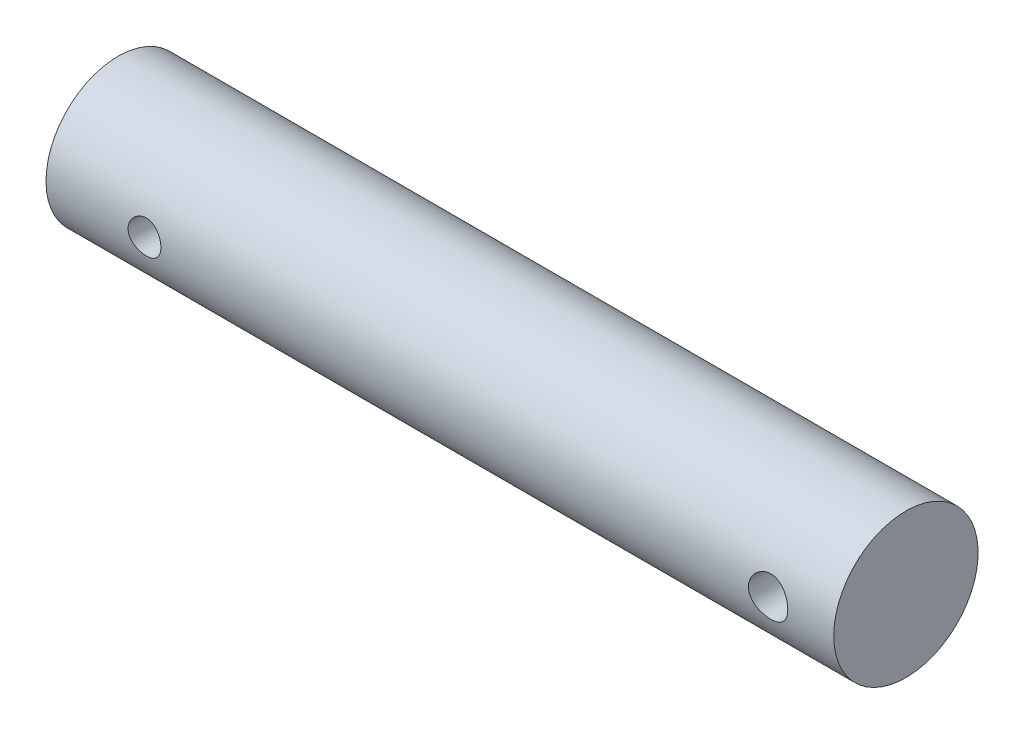
ISO-10303-21;
HEADER;
FILE_DESCRIPTION(('STEP AP214'),'2;1');
FILE_NAME('part.step','',(''),(''),'','','');
FILE_SCHEMA(('AUTOMOTIVE_DESIGN { 1 0 10303 214 1 1 1 1 }'));
ENDSEC;
DATA;
#1=APPLICATION_CONTEXT('core data for automotive mechanical design processes');
#2=APPLICATION_PROTOCOL_DEFINITION('international standard','automotive_design',2000,#1);
#3=PRODUCT_CONTEXT('',#1,'mechanical');
#4=PRODUCT('Part','Part','',(#3));
#5=PRODUCT_RELATED_PRODUCT_CATEGORY('part','',(#4));
#6=PRODUCT_DEFINITION_FORMATION('','',#4);
#7=PRODUCT_DEFINITION_CONTEXT('part definition',#1,'design');
#8=PRODUCT_DEFINITION('design','',#6,#7);
#9=PRODUCT_DEFINITION_SHAPE('','',#8);
#10=(LENGTH_UNIT() NAMED_UNIT(*) SI_UNIT(.MILLI.,.METRE.));
#11=(NAMED_UNIT(*) PLANE_ANGLE_UNIT() SI_UNIT($,.RADIAN.));
#12=(NAMED_UNIT(*) SI_UNIT($,.STERADIAN.) SOLID_ANGLE_UNIT());
#13=UNCERTAINTY_MEASURE_WITH_UNIT(LENGTH_MEASURE(1.E-05),#10,'distance_accuracy_value','');
#14=(GEOMETRIC_REPRESENTATION_CONTEXT(3) GLOBAL_UNCERTAINTY_ASSIGNED_CONTEXT((#13)) GLOBAL_UNIT_ASSIGNED_CONTEXT((#10,
#11,#12)) REPRESENTATION_CONTEXT('',''));
#15=CARTESIAN_POINT('',(0.,0.,0.));
#16=DIRECTION('',(0.,0.,1.));
#17=DIRECTION('',(1.,0.,0.));
#18=AXIS2_PLACEMENT_3D('',#15,#16,#17);
#19=CARTESIAN_POINT('',(0.,0.,0.));
#20=DIRECTION('',(-1.,0.,0.));
#21=DIRECTION('',(0.,0.,1.));
#22=AXIS2_PLACEMENT_3D('',#19,#20,#21);
#23=PLANE('',#22);
#24=CARTESIAN_POINT('',(0.,0.,0.));
#25=DIRECTION('',(-1.,0.,0.));
#26=DIRECTION('',(0.,0.,1.));
#27=AXIS2_PLACEMENT_3D('',#24,#25,#26);
#28=CIRCLE('',#27,11.);
#29=CARTESIAN_POINT('',(0.,0.,11.));
#30=VERTEX_POINT('',#29);
#31=EDGE_CURVE('E56',#30,#30,#28,.T.);
#32=ORIENTED_EDGE('',*,*,#31,.F.);
#33=EDGE_LOOP('',(#32));
#34=FACE_BOUND('',#33,.T.);
#35=ADVANCED_FACE('F36',(#34),#23,.F.);
#36=CARTESIAN_POINT('',(-120.,0.,0.));
#37=DIRECTION('',(-1.,0.,0.));
#38=DIRECTION('',(0.,0.,1.));
#39=AXIS2_PLACEMENT_3D('',#36,#37,#38);
#40=CYLINDRICAL_SURFACE('',#39,11.);
#41=CARTESIAN_POINT('',(-102.5,0.,-11.));
#42=CARTESIAN_POINT('',(-102.500004531826,0.138518278596905,-10.9999974735185));
#43=CARTESIAN_POINT('',(-102.511551227577,0.277090172258008,-10.9973570934613));
#44=CARTESIAN_POINT('',(-102.557379476062,0.550288594599323,-10.987079320306));
#45=CARTESIAN_POINT('',(-102.591676395955,0.68491239222073,-10.9794385496265));
#46=CARTESIAN_POINT('',(-102.681868048632,0.946227671984914,-10.9600095312294));
#47=CARTESIAN_POINT('',(-102.737739327981,1.07292759495647,-10.9482257885674));
#48=CARTESIAN_POINT('',(-102.869417113381,1.31515227582566,-10.921778201627));
#49=CARTESIAN_POINT('',(-102.945223420842,1.43067714503182,-10.9071143860398));
#50=CARTESIAN_POINT('',(-103.116002044607,1.64926760444638,-10.8762265816814));
#51=CARTESIAN_POINT('',(-103.211252573475,1.75211293892049,-10.8599819758326));
#52=CARTESIAN_POINT('',(-103.417618974137,1.9405138981661,-10.827906511833));
#53=CARTESIAN_POINT('',(-103.528736350694,2.02606788121783,-10.8120756930933));
#54=CARTESIAN_POINT('',(-103.765332055284,2.17844599401786,-10.7824158369221));
#55=CARTESIAN_POINT('',(-103.890966996306,2.24503254356575,-10.7686131580577));
#56=CARTESIAN_POINT('',(-104.152009500582,2.35606069717869,-10.7448696147509));
#57=CARTESIAN_POINT('',(-104.287415792062,2.40050517717749,-10.7349282488168));
#58=CARTESIAN_POINT('',(-104.561759187117,2.46525349412717,-10.7202434469831));
#59=CARTESIAN_POINT('',(-104.700599263123,2.48594892680753,-10.715415797339));
#60=CARTESIAN_POINT('',(-104.979858227213,2.50382988451486,-10.7112523406768));
#61=CARTESIAN_POINT('',(-105.120276902662,2.50101853886552,-10.711915802658));
#62=CARTESIAN_POINT('',(-105.395772883349,2.47228016958762,-10.7185835035919));
#63=CARTESIAN_POINT('',(-105.530900906195,2.44681104599437,-10.7244819412976));
#64=CARTESIAN_POINT('',(-105.794914486155,2.37420684920501,-10.7407873672743));
#65=CARTESIAN_POINT('',(-105.923799667627,2.32707047404288,-10.7511946264744));
#66=CARTESIAN_POINT('',(-106.172940671811,2.21205734402543,-10.7754474384537));
#67=CARTESIAN_POINT('',(-106.293113517764,2.14400712086007,-10.7893215597825));
#68=CARTESIAN_POINT('',(-106.520502553111,1.98921977920408,-10.8189276843241));
#69=CARTESIAN_POINT('',(-106.627716840264,1.90247992237134,-10.8346599596346));
#70=CARTESIAN_POINT('',(-106.828778561821,1.71036518003517,-10.8666615287251));
#71=CARTESIAN_POINT('',(-106.922254426516,1.60460166742827,-10.882934773515));
#72=CARTESIAN_POINT('',(-107.090205888707,1.37871229840972,-10.9138502597158));
#73=CARTESIAN_POINT('',(-107.164681086699,1.25858614009079,-10.9284924668293));
#74=CARTESIAN_POINT('',(-107.292620387971,1.00690799179915,-10.9545497424637));
#75=CARTESIAN_POINT('',(-107.346032773622,0.875328834348153,-10.9659568484873));
#76=CARTESIAN_POINT('',(-107.429884005868,0.604745122491693,-10.9841998956698));
#77=CARTESIAN_POINT('',(-107.460326465822,0.465741739663716,-10.9910365557784));
#78=CARTESIAN_POINT('',(-107.496826237473,0.187439840192729,-10.9992650071756));
#79=CARTESIAN_POINT('',(-107.503390691317,0.0482110923370351,-11.0007700184113));
#80=CARTESIAN_POINT('',(-107.493326960147,-0.229353886680105,-10.9984842255063));
#81=CARTESIAN_POINT('',(-107.476700480594,-0.367690182720859,-10.9946938107912));
#82=CARTESIAN_POINT('',(-107.421146833095,-0.63784167721846,-10.9823148103741));
#83=CARTESIAN_POINT('',(-107.382488453556,-0.769715036814428,-10.973784087055));
#84=CARTESIAN_POINT('',(-107.284268972543,-1.02510393087761,-10.9528806132367));
#85=CARTESIAN_POINT('',(-107.224705995747,-1.14861871432289,-10.9405075180554));
#86=CARTESIAN_POINT('',(-107.085330856445,-1.38586085256055,-10.9130143275095));
#87=CARTESIAN_POINT('',(-107.005224373227,-1.49941068522719,-10.8978552985532));
#88=CARTESIAN_POINT('',(-106.82742067156,-1.71163773579051,-10.866546095646));
#89=CARTESIAN_POINT('',(-106.729720973453,-1.81031285357969,-10.8503957821912));
#90=CARTESIAN_POINT('',(-106.517169034867,-1.99201706218095,-10.8185287714487));
#91=CARTESIAN_POINT('',(-106.402012758213,-2.07469366594061,-10.8028272119253));
#92=CARTESIAN_POINT('',(-106.15915360933,-2.21953814406552,-10.7740023321604));
#93=CARTESIAN_POINT('',(-106.03145129204,-2.28170692501016,-10.7608788979592));
#94=CARTESIAN_POINT('',(-105.767819530431,-2.38333597241927,-10.7388274870674));
#95=CARTESIAN_POINT('',(-105.631942676257,-2.42292716221704,-10.7298753781702));
#96=CARTESIAN_POINT('',(-105.355233093301,-2.47865258340364,-10.7171411058581));
#97=CARTESIAN_POINT('',(-105.214401234864,-2.49479091341613,-10.7133580391079));
#98=CARTESIAN_POINT('',(-104.935341380689,-2.50296739214164,-10.7114502943222));
#99=CARTESIAN_POINT('',(-104.797130400666,-2.4955654850107,-10.7131941458177));
#100=CARTESIAN_POINT('',(-104.523981089812,-2.45813115403283,-10.7218446846914));
#101=CARTESIAN_POINT('',(-104.38904271389,-2.42809904217009,-10.7287513008948));
#102=CARTESIAN_POINT('',(-104.126756602634,-2.34653692360608,-10.7468826027048));
#103=CARTESIAN_POINT('',(-103.999380308858,-2.29509457527994,-10.758089666867));
#104=CARTESIAN_POINT('',(-103.754985293099,-2.17224536606879,-10.783564723281));
#105=CARTESIAN_POINT('',(-103.637967749674,-2.10083623731222,-10.7978330631966));
#106=CARTESIAN_POINT('',(-103.414865572345,-1.93824996891048,-10.828211072634));
#107=CARTESIAN_POINT('',(-103.309074277793,-1.84667645642833,-10.8443540558786));
#108=CARTESIAN_POINT('',(-103.114176814918,-1.64715628932416,-10.8764454859305));
#109=CARTESIAN_POINT('',(-103.025074529034,-1.53920583540675,-10.8923938866665));
#110=CARTESIAN_POINT('',(-102.864861939766,-1.30814060515056,-10.9225693389041));
#111=CARTESIAN_POINT('',(-102.794026176667,-1.18483162187619,-10.9367686161711));
#112=CARTESIAN_POINT('',(-102.674200029337,-0.927755967711679,-10.9615640551399));
#113=CARTESIAN_POINT('',(-102.625192005213,-0.793997844337687,-10.9721631246672));
#114=CARTESIAN_POINT('',(-102.558772093824,-0.550163071539616,-10.9867559512784));
#115=CARTESIAN_POINT('',(-102.536776012311,-0.441368111138484,-10.9916908558499));
#116=CARTESIAN_POINT('',(-102.507388526421,-0.221726814930914,-10.9983138080738));
#117=CARTESIAN_POINT('',(-102.499996372381,-0.1108805847171,-11.0000020223883));
#118=CARTESIAN_POINT('',(-102.5,0.,-11.));
#119=B_SPLINE_CURVE_WITH_KNOTS('',3,(#41,#42,#43,#44,#45,#46,#47,#48,#49,#50,#51,#52,#53,#54,
#55,#56,#57,#58,#59,#60,#61,#62,#63,#64,#65,#66,#67,#68,#69,#70,#71,#72,#73,#74,#75,#76,#77,#78,
#79,#80,#81,#82,#83,#84,#85,#86,#87,#88,#89,#90,#91,#92,#93,#94,#95,#96,#97,#98,#99,#100,#101,
#102,#103,#104,#105,#106,#107,#108,#109,#110,#111,#112,#113,#114,#115,#116,#117,#118),
.UNSPECIFIED.,.T.,.F.,(4,2,2,2,2,2,2,2,2,2,2,2,2,2,2,2,2,2,2,2,2,2,2,2,2,2,2,2,2,2,2,2,2,2,2,2,
2,2,4),(0.,0.415148849633316,0.830578406996926,1.24555761755318,1.66053269430525,
2.08192389396808,2.50335508365802,2.92985362973414,3.35629676538239,3.7756024489808,
4.19485231368757,4.60581714174234,5.01680666753971,5.43130157438849,5.84585725297975,
6.27011531803702,6.69438230269861,7.11968464096646,7.54492006169894,7.9610694191676,
8.37718817463625,8.78833576149034,9.19952024123081,9.61696129328764,10.0344612272567,
10.4603132154039,10.8861463755947,11.3094844190899,11.7327484710939,12.1460204395145,
12.5592867105953,12.9708773657614,13.382514789318,13.8031102578591,14.2238034502006,
14.6504927745346,15.0768366452215,15.4091704772435,15.74148724914),.UNSPECIFIED.);
#120=CARTESIAN_POINT('',(-102.5,0.,-11.));
#121=VERTEX_POINT('',#120);
#122=EDGE_CURVE('E109',#121,#121,#119,.T.);
#123=ORIENTED_EDGE('',*,*,#122,.T.);
#124=EDGE_LOOP('',(#123));
#125=FACE_BOUND('',#124,.T.);
#126=CARTESIAN_POINT('',(-102.5,0.,11.));
#127=CARTESIAN_POINT('',(-102.500004531826,-0.138518278596904,10.9999974735185));
#128=CARTESIAN_POINT('',(-102.511551227577,-0.277090172258008,10.9973570934613));
#129=CARTESIAN_POINT('',(-102.557379476062,-0.550288594599322,10.987079320306));
#130=CARTESIAN_POINT('',(-102.591676395955,-0.684912392220729,10.9794385496265));
#131=CARTESIAN_POINT('',(-102.681868048632,-0.946227671984914,10.9600095312294));
#132=CARTESIAN_POINT('',(-102.737739327981,-1.07292759495647,10.9482257885674));
#133=CARTESIAN_POINT('',(-102.869417113381,-1.31515227582566,10.921778201627));
#134=CARTESIAN_POINT('',(-102.945223420842,-1.43067714503182,10.9071143860398));
#135=CARTESIAN_POINT('',(-103.116002044607,-1.64926760444638,10.8762265816814));
#136=CARTESIAN_POINT('',(-103.211252573475,-1.75211293892049,10.8599819758326));
#137=CARTESIAN_POINT('',(-103.417618974137,-1.9405138981661,10.827906511833));
#138=CARTESIAN_POINT('',(-103.528736350694,-2.02606788121783,10.8120756930933));
#139=CARTESIAN_POINT('',(-103.765332055284,-2.17844599401786,10.7824158369221));
#140=CARTESIAN_POINT('',(-103.890966996306,-2.24503254356575,10.7686131580577));
#141=CARTESIAN_POINT('',(-104.152009500582,-2.3560606971787,10.7448696147509));
#142=CARTESIAN_POINT('',(-104.287415792062,-2.40050517717749,10.7349282488168));
#143=CARTESIAN_POINT('',(-104.561759187117,-2.46525349412718,10.7202434469831));
#144=CARTESIAN_POINT('',(-104.700599263123,-2.48594892680753,10.715415797339));
#145=CARTESIAN_POINT('',(-104.979858227213,-2.50382988451486,10.7112523406768));
#146=CARTESIAN_POINT('',(-105.120276902662,-2.50101853886552,10.711915802658));
#147=CARTESIAN_POINT('',(-105.395772883349,-2.47228016958762,10.7185835035919));
#148=CARTESIAN_POINT('',(-105.530900906195,-2.44681104599437,10.7244819412976));
#149=CARTESIAN_POINT('',(-105.794914486155,-2.37420684920501,10.7407873672743));
#150=CARTESIAN_POINT('',(-105.923799667627,-2.32707047404288,10.7511946264744));
#151=CARTESIAN_POINT('',(-106.172940671811,-2.21205734402543,10.7754474384537));
#152=CARTESIAN_POINT('',(-106.293113517764,-2.14400712086007,10.7893215597825));
#153=CARTESIAN_POINT('',(-106.520502553111,-1.98921977920408,10.8189276843241));
#154=CARTESIAN_POINT('',(-106.627716840264,-1.90247992237134,10.8346599596346));
#155=CARTESIAN_POINT('',(-106.828778561821,-1.71036518003517,10.8666615287251));
#156=CARTESIAN_POINT('',(-106.922254426516,-1.60460166742828,10.882934773515));
#157=CARTESIAN_POINT('',(-107.090205888707,-1.37871229840973,10.9138502597158));
#158=CARTESIAN_POINT('',(-107.164681086699,-1.2585861400908,10.9284924668293));
#159=CARTESIAN_POINT('',(-107.292620387971,-1.00690799179915,10.9545497424637));
#160=CARTESIAN_POINT('',(-107.346032773622,-0.875328834348153,10.9659568484873));
#161=CARTESIAN_POINT('',(-107.429884005868,-0.604745122491694,10.9841998956698));
#162=CARTESIAN_POINT('',(-107.460326465822,-0.465741739663717,10.9910365557784));
#163=CARTESIAN_POINT('',(-107.496826237473,-0.187439840192731,10.9992650071756));
#164=CARTESIAN_POINT('',(-107.503390691317,-0.0482110923370366,11.0007700184113));
#165=CARTESIAN_POINT('',(-107.493326960147,0.229353886680104,10.9984842255063));
#166=CARTESIAN_POINT('',(-107.476700480594,0.367690182720858,10.9946938107912));
#167=CARTESIAN_POINT('',(-107.421146833095,0.637841677218456,10.9823148103741));
#168=CARTESIAN_POINT('',(-107.382488453556,0.769715036814421,10.973784087055));
#169=CARTESIAN_POINT('',(-107.284268972543,1.0251039308776,10.9528806132367));
#170=CARTESIAN_POINT('',(-107.224705995747,1.14861871432288,10.9405075180554));
#171=CARTESIAN_POINT('',(-107.085330856445,1.38586085256055,10.9130143275095));
#172=CARTESIAN_POINT('',(-107.005224373227,1.49941068522719,10.8978552985532));
#173=CARTESIAN_POINT('',(-106.82742067156,1.71163773579051,10.866546095646));
#174=CARTESIAN_POINT('',(-106.729720973453,1.81031285357969,10.8503957821912));
#175=CARTESIAN_POINT('',(-106.517169034867,1.99201706218095,10.8185287714487));
#176=CARTESIAN_POINT('',(-106.402012758213,2.07469366594061,10.8028272119253));
#177=CARTESIAN_POINT('',(-106.15915360933,2.21953814406552,10.7740023321604));
#178=CARTESIAN_POINT('',(-106.03145129204,2.28170692501016,10.7608788979592));
#179=CARTESIAN_POINT('',(-105.767819530431,2.38333597241927,10.7388274870674));
#180=CARTESIAN_POINT('',(-105.631942676257,2.42292716221704,10.7298753781702));
#181=CARTESIAN_POINT('',(-105.355233093301,2.47865258340364,10.7171411058581));
#182=CARTESIAN_POINT('',(-105.214401234864,2.49479091341613,10.7133580391079));
#183=CARTESIAN_POINT('',(-104.935341380689,2.50296739214164,10.7114502943222));
#184=CARTESIAN_POINT('',(-104.797130400666,2.4955654850107,10.7131941458177));
#185=CARTESIAN_POINT('',(-104.523981089812,2.45813115403283,10.7218446846914));
#186=CARTESIAN_POINT('',(-104.38904271389,2.42809904217009,10.7287513008948));
#187=CARTESIAN_POINT('',(-104.126756602634,2.34653692360608,10.7468826027048));
#188=CARTESIAN_POINT('',(-103.999380308858,2.29509457527994,10.758089666867));
#189=CARTESIAN_POINT('',(-103.754985293099,2.17224536606879,10.783564723281));
#190=CARTESIAN_POINT('',(-103.637967749674,2.10083623731222,10.7978330631966));
#191=CARTESIAN_POINT('',(-103.414865572345,1.93824996891048,10.828211072634));
#192=CARTESIAN_POINT('',(-103.309074277793,1.84667645642833,10.8443540558786));
#193=CARTESIAN_POINT('',(-103.114176814918,1.64715628932416,10.8764454859305));
#194=CARTESIAN_POINT('',(-103.025074529034,1.53920583540675,10.8923938866665));
#195=CARTESIAN_POINT('',(-102.864861939766,1.30814060515055,10.9225693389041));
#196=CARTESIAN_POINT('',(-102.794026176667,1.18483162187619,10.9367686161711));
#197=CARTESIAN_POINT('',(-102.674200029337,0.927755967711679,10.9615640551399));
#198=CARTESIAN_POINT('',(-102.625192005213,0.793997844337687,10.9721631246672));
#199=CARTESIAN_POINT('',(-102.558772093824,0.550163071539616,10.9867559512784));
#200=CARTESIAN_POINT('',(-102.536776012311,0.441368111138484,10.9916908558499));
#201=CARTESIAN_POINT('',(-102.507388526421,0.221726814930913,10.9983138080738));
#202=CARTESIAN_POINT('',(-102.499996372381,0.110880584717099,11.0000020223883));
#203=CARTESIAN_POINT('',(-102.5,0.,11.));
#204=B_SPLINE_CURVE_WITH_KNOTS('',3,(#126,#127,#128,#129,#130,#131,#132,#133,#134,#135,#136,
#137,#138,#139,#140,#141,#142,#143,#144,#145,#146,#147,#148,#149,#150,#151,#152,#153,#154,#155,
#156,#157,#158,#159,#160,#161,#162,#163,#164,#165,#166,#167,#168,#169,#170,#171,#172,#173,#174,
#175,#176,#177,#178,#179,#180,#181,#182,#183,#184,#185,#186,#187,#188,#189,#190,#191,#192,#193,
#194,#195,#196,#197,#198,#199,#200,#201,#202,#203),.UNSPECIFIED.,.T.,.F.,(4,2,2,2,2,2,2,2,2,2,2,
2,2,2,2,2,2,2,2,2,2,2,2,2,2,2,2,2,2,2,2,2,2,2,2,2,2,2,4),(0.,0.415148849633315,
0.830578406996926,1.24555761755318,1.66053269430525,2.08192389396808,2.50335508365802,
2.92985362973414,3.35629676538239,3.77560244898081,4.19485231368757,4.60581714174234,
5.01680666753971,5.43130157438849,5.84585725297975,6.270115318037,6.69438230269861,
7.11968464096646,7.54492006169893,7.9610694191676,8.37718817463625,8.78833576149033,
9.1995202412308,9.61696129328764,10.0344612272567,10.4603132154039,10.8861463755947,
11.3094844190899,11.7327484710939,12.1460204395145,12.5592867105953,12.9708773657614,
13.382514789318,13.8031102578591,14.2238034502006,14.6504927745346,15.0768366452215,
15.4091704772435,15.74148724914),.UNSPECIFIED.);
#205=CARTESIAN_POINT('',(-102.5,0.,11.));
#206=VERTEX_POINT('',#205);
#207=EDGE_CURVE('E119',#206,#206,#204,.T.);
#208=ORIENTED_EDGE('',*,*,#207,.T.);
#209=EDGE_LOOP('',(#208));
#210=FACE_BOUND('',#209,.T.);
#211=CARTESIAN_POINT('',(-6.99999999999999,0.,-11.));
#212=CARTESIAN_POINT('',(-7.00000362522205,0.165241826664387,-10.9999976543482));
#213=CARTESIAN_POINT('',(-7.01369812716682,0.330521957625416,-10.9962401452152));
#214=CARTESIAN_POINT('',(-7.06801166060635,0.656311860315395,-10.981615961709));
#215=CARTESIAN_POINT('',(-7.10864278325719,0.81681945595453,-10.97074609481));
#216=CARTESIAN_POINT('',(-7.21540346347684,1.12831525211079,-10.9430954434827));
#217=CARTESIAN_POINT('',(-7.28149930532382,1.27931573394033,-10.9263224773879));
#218=CARTESIAN_POINT('',(-7.43718586532484,1.56808899231944,-10.8886330882569));
#219=CARTESIAN_POINT('',(-7.52677843270785,1.70586072657955,-10.8677163391303));
#220=CARTESIAN_POINT('',(-7.72919967293452,1.96759389514652,-10.8234279408412));
#221=CARTESIAN_POINT('',(-7.8424908817084,2.09119025833987,-10.8000128298086));
#222=CARTESIAN_POINT('',(-8.0881052720598,2.31788587364956,-10.7536422587012));
#223=CARTESIAN_POINT('',(-8.22043102080462,2.42098235649443,-10.7306868611041));
#224=CARTESIAN_POINT('',(-8.50330249515894,2.60555589078995,-10.6873876832732));
#225=CARTESIAN_POINT('',(-8.65413428987255,2.68660853675173,-10.6670986011725));
#226=CARTESIAN_POINT('',(-8.96792765639874,2.82205832722455,-10.6320701482383));
#227=CARTESIAN_POINT('',(-9.13088686977697,2.87646063893688,-10.6173297017151));
#228=CARTESIAN_POINT('',(-9.46025579002493,2.95578912882536,-10.5955169438548));
#229=CARTESIAN_POINT('',(-9.62649389632383,2.98137921086458,-10.5882722456757));
#230=CARTESIAN_POINT('',(-9.96104936601761,3.00442728818267,-10.5817565816817));
#231=CARTESIAN_POINT('',(-10.129366315,3.00189080281765,-10.5824840514652));
#232=CARTESIAN_POINT('',(-10.4580831019325,2.96928383560602,-10.5916764975091));
#233=CARTESIAN_POINT('',(-10.6185704692045,2.94002147337865,-10.5999143662734));
#234=CARTESIAN_POINT('',(-10.9322665720456,2.85608967743614,-10.6228351158812));
#235=CARTESIAN_POINT('',(-11.0854747009326,2.80141813009295,-10.6375185328831));
#236=CARTESIAN_POINT('',(-11.3823470410949,2.66757259652941,-10.6718723658465));
#237=CARTESIAN_POINT('',(-11.5258784020672,2.58811903765895,-10.6915991952828));
#238=CARTESIAN_POINT('',(-11.7978528948193,2.40715976044348,-10.7337873759558));
#239=CARTESIAN_POINT('',(-11.9262929256775,2.30564952212418,-10.756249287265));
#240=CARTESIAN_POINT('',(-12.1690503796129,2.07934693365792,-10.8023178998121));
#241=CARTESIAN_POINT('',(-12.2827348985779,1.9538772923345,-10.8259374859423));
#242=CARTESIAN_POINT('',(-12.4875819299556,1.68536402357727,-10.8709729541596));
#243=CARTESIAN_POINT('',(-12.5787434720992,1.54231963943711,-10.8923887412858));
#244=CARTESIAN_POINT('',(-12.7362533455498,1.24170790747925,-10.9307455624252));
#245=CARTESIAN_POINT('',(-12.8024826771679,1.08407527483555,-10.9476650257461));
#246=CARTESIAN_POINT('',(-12.9073159450283,0.75934537742878,-10.9749671228522));
#247=CARTESIAN_POINT('',(-12.9459262048883,0.592250288635363,-10.9853512528913));
#248=CARTESIAN_POINT('',(-12.9934212355939,0.258736340966502,-10.9981845755262));
#249=CARTESIAN_POINT('',(-13.0031659906407,0.092448595567961,-11.0008632625074));
#250=CARTESIAN_POINT('',(-12.9950345049731,-0.239386731275946,-10.9986460317028));
#251=CARTESIAN_POINT('',(-12.977161260767,-0.404934391065018,-10.9937509356601));
#252=CARTESIAN_POINT('',(-12.9150049945937,-0.727490195479109,-10.977084785319));
#253=CARTESIAN_POINT('',(-12.871205614486,-0.884598648545339,-10.9654397294419));
#254=CARTESIAN_POINT('',(-12.759005510719,-1.18921973489728,-10.9365984707135));
#255=CARTESIAN_POINT('',(-12.6906020606773,-1.33673130261004,-10.9194016526918));
#256=CARTESIAN_POINT('',(-12.5295671154288,-1.62128232238913,-10.8808314765631));
#257=CARTESIAN_POINT('',(-12.4364730254774,-1.75804920482497,-10.8593805909887));
#258=CARTESIAN_POINT('',(-12.229277424909,-2.01432044026183,-10.8147797682096));
#259=CARTESIAN_POINT('',(-12.1151715676829,-2.133821212356,-10.7916294800542));
#260=CARTESIAN_POINT('',(-11.8651719239324,-2.35582120688549,-10.7453880311357));
#261=CARTESIAN_POINT('',(-11.7287332354501,-2.45771255494154,-10.7223188995483));
#262=CARTESIAN_POINT('',(-11.4402027055534,-2.63717164416209,-10.6796005238856));
#263=CARTESIAN_POINT('',(-11.2881114907549,-2.71474035852927,-10.6599511429925));
#264=CARTESIAN_POINT('',(-10.9733187435356,-2.84277116633766,-10.6265249735947));
#265=CARTESIAN_POINT('',(-10.8106834790394,-2.8933870461064,-10.6127149622546));
#266=CARTESIAN_POINT('',(-10.4787663240444,-2.9664183443807,-10.5925362923412));
#267=CARTESIAN_POINT('',(-10.3094862409314,-2.98884137725659,-10.586165624571));
#268=CARTESIAN_POINT('',(-9.97532319232942,-3.00439791154423,-10.5817601934995));
#269=CARTESIAN_POINT('',(-9.81048882250414,-2.99851066433394,-10.5834467188085));
#270=CARTESIAN_POINT('',(-9.48425870449437,-2.95989675286934,-10.5943100332908));
#271=CARTESIAN_POINT('',(-9.32286286010058,-2.92717084057027,-10.6034866126106));
#272=CARTESIAN_POINT('',(-9.00938736846222,-2.83638816870609,-10.6281263302191));
#273=CARTESIAN_POINT('',(-8.85724049352036,-2.77854790898354,-10.6435356626191));
#274=CARTESIAN_POINT('',(-8.56469344636944,-2.63934609082672,-10.6789037996565));
#275=CARTESIAN_POINT('',(-8.4242951978686,-2.55798069008885,-10.6988633473566));
#276=CARTESIAN_POINT('',(-8.15457880461579,-2.37110861969731,-10.7418475876651));
#277=CARTESIAN_POINT('',(-8.02573259031406,-2.26493803644257,-10.7649475169129));
#278=CARTESIAN_POINT('',(-7.78736718641049,-2.0327202239854,-10.8111998098094));
#279=CARTESIAN_POINT('',(-7.67785275198925,-1.90666811877597,-10.834352184944));
#280=CARTESIAN_POINT('',(-7.47881077096126,-1.63481545137218,-10.8787291835493));
#281=CARTESIAN_POINT('',(-7.38979303826606,-1.48863173252504,-10.8998981550767));
#282=CARTESIAN_POINT('',(-7.23773512757702,-1.18279979967855,-10.9373052756075));
#283=CARTESIAN_POINT('',(-7.17467903889133,-1.02315990484244,-10.9535464430238));
#284=CARTESIAN_POINT('',(-7.08412098004201,-0.720200202436421,-10.9772838799153));
#285=CARTESIAN_POINT('',(-7.05265089751659,-0.578129280524934,-10.9857389536219));
#286=CARTESIAN_POINT('',(-7.01058994936234,-0.290715215882967,-10.997097743287));
#287=CARTESIAN_POINT('',(-6.9999968106904,-0.145372431129893,-11.0000020636004));
#288=CARTESIAN_POINT('',(-6.99999999999999,0.,-11.));
#289=B_SPLINE_CURVE_WITH_KNOTS('',3,(#211,#212,#213,#214,#215,#216,#217,#218,#219,#220,#221,
#222,#223,#224,#225,#226,#227,#228,#229,#230,#231,#232,#233,#234,#235,#236,#237,#238,#239,#240,
#241,#242,#243,#244,#245,#246,#247,#248,#249,#250,#251,#252,#253,#254,#255,#256,#257,#258,#259,
#260,#261,#262,#263,#264,#265,#266,#267,#268,#269,#270,#271,#272,#273,#274,#275,#276,#277,#278,
#279,#280,#281,#282,#283,#284,#285,#286,#287,#288),.UNSPECIFIED.,.T.,.F.,(4,2,2,2,2,2,2,2,2,2,2,
2,2,2,2,2,2,2,2,2,2,2,2,2,2,2,2,2,2,2,2,2,2,2,2,2,2,2,4),(0.,0.495192213709794,0.9906068571026,
1.48536780484116,1.98016770272941,2.48571756446357,2.99133567318647,3.50609187300439,
4.02074822781993,4.52328609721851,5.02572535393076,5.51345773349774,6.00123069167434,
6.49471853535856,6.98830760278243,7.4987705710155,8.00925552568848,8.52214699472057,
9.03492099533888,9.53225622686166,10.029537502105,10.5178222240039,11.0061610695167,
11.5043893801936,12.0027208731201,12.5158014612974,13.0288615173582,13.5389619291417,
14.0489245425547,14.5413770446734,15.0338157499215,15.5220911132461,16.0104462704815,
16.5137802279716,17.0172378222293,17.532117445911,18.0466810522785,18.4823766419936,
18.9180247913559),.UNSPECIFIED.);
#290=CARTESIAN_POINT('',(-6.99999999999999,0.,-11.));
#291=VERTEX_POINT('',#290);
#292=EDGE_CURVE('E10',#291,#291,#289,.T.);
#293=ORIENTED_EDGE('',*,*,#292,.T.);
#294=EDGE_LOOP('',(#293));
#295=FACE_BOUND('',#294,.T.);
#296=CARTESIAN_POINT('',(-6.99999999999999,0.,11.));
#297=CARTESIAN_POINT('',(-7.00000362522205,-0.165241826664387,10.9999976543482));
#298=CARTESIAN_POINT('',(-7.01369812716682,-0.330521957625415,10.9962401452152));
#299=CARTESIAN_POINT('',(-7.06801166060635,-0.656311860315395,10.981615961709));
#300=CARTESIAN_POINT('',(-7.10864278325719,-0.81681945595453,10.97074609481));
#301=CARTESIAN_POINT('',(-7.21540346347684,-1.12831525211079,10.9430954434827));
#302=CARTESIAN_POINT('',(-7.28149930532382,-1.27931573394033,10.9263224773879));
#303=CARTESIAN_POINT('',(-7.43718586532484,-1.56808899231944,10.8886330882569));
#304=CARTESIAN_POINT('',(-7.52677843270785,-1.70586072657955,10.8677163391303));
#305=CARTESIAN_POINT('',(-7.72919967293452,-1.96759389514652,10.8234279408412));
#306=CARTESIAN_POINT('',(-7.8424908817084,-2.09119025833987,10.8000128298086));
#307=CARTESIAN_POINT('',(-8.0881052720598,-2.31788587364956,10.7536422587012));
#308=CARTESIAN_POINT('',(-8.22043102080462,-2.42098235649443,10.7306868611041));
#309=CARTESIAN_POINT('',(-8.50330249515894,-2.60555589078995,10.6873876832732));
#310=CARTESIAN_POINT('',(-8.65413428987255,-2.68660853675173,10.6670986011725));
#311=CARTESIAN_POINT('',(-8.96792765639874,-2.82205832722455,10.6320701482383));
#312=CARTESIAN_POINT('',(-9.13088686977697,-2.87646063893688,10.6173297017151));
#313=CARTESIAN_POINT('',(-9.46025579002493,-2.95578912882536,10.5955169438548));
#314=CARTESIAN_POINT('',(-9.62649389632383,-2.98137921086458,10.5882722456757));
#315=CARTESIAN_POINT('',(-9.96104936601761,-3.00442728818267,10.5817565816817));
#316=CARTESIAN_POINT('',(-10.129366315,-3.00189080281765,10.5824840514652));
#317=CARTESIAN_POINT('',(-10.4580831019325,-2.96928383560602,10.5916764975091));
#318=CARTESIAN_POINT('',(-10.6185704692045,-2.94002147337865,10.5999143662734));
#319=CARTESIAN_POINT('',(-10.9322665720456,-2.85608967743614,10.6228351158812));
#320=CARTESIAN_POINT('',(-11.0854747009326,-2.80141813009295,10.6375185328831));
#321=CARTESIAN_POINT('',(-11.3823470410949,-2.66757259652941,10.6718723658465));
#322=CARTESIAN_POINT('',(-11.5258784020672,-2.58811903765895,10.6915991952828));
#323=CARTESIAN_POINT('',(-11.7978528948193,-2.40715976044348,10.7337873759558));
#324=CARTESIAN_POINT('',(-11.9262929256775,-2.30564952212418,10.756249287265));
#325=CARTESIAN_POINT('',(-12.1690503796129,-2.07934693365792,10.8023178998121));
#326=CARTESIAN_POINT('',(-12.2827348985779,-1.9538772923345,10.8259374859423));
#327=CARTESIAN_POINT('',(-12.4875819299556,-1.68536402357727,10.8709729541596));
#328=CARTESIAN_POINT('',(-12.5787434720992,-1.54231963943711,10.8923887412858));
#329=CARTESIAN_POINT('',(-12.7362533455498,-1.24170790747925,10.9307455624252));
#330=CARTESIAN_POINT('',(-12.8024826771679,-1.08407527483555,10.9476650257461));
#331=CARTESIAN_POINT('',(-12.9073159450283,-0.75934537742878,10.9749671228522));
#332=CARTESIAN_POINT('',(-12.9459262048883,-0.592250288635363,10.9853512528913));
#333=CARTESIAN_POINT('',(-12.9934212355939,-0.258736340966502,10.9981845755262));
#334=CARTESIAN_POINT('',(-13.0031659906407,-0.092448595567961,11.0008632625074));
#335=CARTESIAN_POINT('',(-12.9950345049731,0.239386731275946,10.9986460317028));
#336=CARTESIAN_POINT('',(-12.977161260767,0.404934391065018,10.9937509356601));
#337=CARTESIAN_POINT('',(-12.9150049945937,0.727490195479109,10.977084785319));
#338=CARTESIAN_POINT('',(-12.871205614486,0.884598648545339,10.9654397294419));
#339=CARTESIAN_POINT('',(-12.759005510719,1.18921973489728,10.9365984707135));
#340=CARTESIAN_POINT('',(-12.6906020606773,1.33673130261004,10.9194016526918));
#341=CARTESIAN_POINT('',(-12.5295671154288,1.62128232238913,10.8808314765631));
#342=CARTESIAN_POINT('',(-12.4364730254774,1.75804920482497,10.8593805909887));
#343=CARTESIAN_POINT('',(-12.229277424909,2.01432044026183,10.8147797682096));
#344=CARTESIAN_POINT('',(-12.1151715676829,2.133821212356,10.7916294800542));
#345=CARTESIAN_POINT('',(-11.8651719239324,2.35582120688549,10.7453880311357));
#346=CARTESIAN_POINT('',(-11.7287332354501,2.45771255494154,10.7223188995483));
#347=CARTESIAN_POINT('',(-11.4402027055534,2.63717164416209,10.6796005238856));
#348=CARTESIAN_POINT('',(-11.2881114907549,2.71474035852927,10.6599511429925));
#349=CARTESIAN_POINT('',(-10.9733187435356,2.84277116633766,10.6265249735947));
#350=CARTESIAN_POINT('',(-10.8106834790394,2.8933870461064,10.6127149622546));
#351=CARTESIAN_POINT('',(-10.4787663240444,2.9664183443807,10.5925362923412));
#352=CARTESIAN_POINT('',(-10.3094862409314,2.98884137725659,10.586165624571));
#353=CARTESIAN_POINT('',(-9.97532319232942,3.00439791154423,10.5817601934995));
#354=CARTESIAN_POINT('',(-9.81048882250414,2.99851066433394,10.5834467188085));
#355=CARTESIAN_POINT('',(-9.48425870449437,2.95989675286934,10.5943100332908));
#356=CARTESIAN_POINT('',(-9.32286286010058,2.92717084057027,10.6034866126106));
#357=CARTESIAN_POINT('',(-9.00938736846222,2.83638816870609,10.6281263302191));
#358=CARTESIAN_POINT('',(-8.85724049352036,2.77854790898354,10.6435356626191));
#359=CARTESIAN_POINT('',(-8.56469344636944,2.63934609082672,10.6789037996565));
#360=CARTESIAN_POINT('',(-8.4242951978686,2.55798069008885,10.6988633473566));
#361=CARTESIAN_POINT('',(-8.15457880461579,2.37110861969731,10.7418475876651));
#362=CARTESIAN_POINT('',(-8.02573259031406,2.26493803644257,10.7649475169129));
#363=CARTESIAN_POINT('',(-7.78736718641049,2.0327202239854,10.8111998098094));
#364=CARTESIAN_POINT('',(-7.67785275198925,1.90666811877597,10.834352184944));
#365=CARTESIAN_POINT('',(-7.47881077096126,1.63481545137218,10.8787291835493));
#366=CARTESIAN_POINT('',(-7.38979303826606,1.48863173252504,10.8998981550767));
#367=CARTESIAN_POINT('',(-7.23773512757702,1.18279979967855,10.9373052756075));
#368=CARTESIAN_POINT('',(-7.17467903889133,1.02315990484244,10.9535464430238));
#369=CARTESIAN_POINT('',(-7.08412098004201,0.720200202436421,10.9772838799153));
#370=CARTESIAN_POINT('',(-7.05265089751659,0.578129280524934,10.9857389536219));
#371=CARTESIAN_POINT('',(-7.01058994936234,0.290715215882966,10.997097743287));
#372=CARTESIAN_POINT('',(-6.9999968106904,0.145372431129893,11.0000020636004));
#373=CARTESIAN_POINT('',(-6.99999999999999,0.,11.));
#374=B_SPLINE_CURVE_WITH_KNOTS('',3,(#296,#297,#298,#299,#300,#301,#302,#303,#304,#305,#306,
#307,#308,#309,#310,#311,#312,#313,#314,#315,#316,#317,#318,#319,#320,#321,#322,#323,#324,#325,
#326,#327,#328,#329,#330,#331,#332,#333,#334,#335,#336,#337,#338,#339,#340,#341,#342,#343,#344,
#345,#346,#347,#348,#349,#350,#351,#352,#353,#354,#355,#356,#357,#358,#359,#360,#361,#362,#363,
#364,#365,#366,#367,#368,#369,#370,#371,#372,#373),.UNSPECIFIED.,.T.,.F.,(4,2,2,2,2,2,2,2,2,2,2,
2,2,2,2,2,2,2,2,2,2,2,2,2,2,2,2,2,2,2,2,2,2,2,2,2,2,2,4),(0.,0.495192213709794,0.9906068571026,
1.48536780484116,1.98016770272941,2.48571756446357,2.99133567318647,3.50609187300439,
4.02074822781993,4.52328609721851,5.02572535393076,5.51345773349774,6.00123069167434,
6.49471853535856,6.98830760278243,7.4987705710155,8.00925552568848,8.52214699472057,
9.03492099533888,9.53225622686166,10.029537502105,10.5178222240039,11.0061610695167,
11.5043893801936,12.0027208731201,12.5158014612974,13.0288615173582,13.5389619291417,
14.0489245425547,14.5413770446734,15.0338157499215,15.5220911132461,16.0104462704815,
16.5137802279716,17.0172378222293,17.532117445911,18.0466810522785,18.4823766419936,
18.9180247913559),.UNSPECIFIED.);
#375=CARTESIAN_POINT('',(-6.99999999999999,0.,11.));
#376=VERTEX_POINT('',#375);
#377=EDGE_CURVE('E49',#376,#376,#374,.T.);
#378=ORIENTED_EDGE('',*,*,#377,.T.);
#379=EDGE_LOOP('',(#378));
#380=FACE_BOUND('',#379,.T.);
#381=CARTESIAN_POINT('',(-120.,0.,0.));
#382=DIRECTION('',(-1.,0.,0.));
#383=DIRECTION('',(0.,0.,1.));
#384=AXIS2_PLACEMENT_3D('',#381,#382,#383);
#385=CIRCLE('',#384,11.);
#386=CARTESIAN_POINT('',(-120.,0.,11.));
#387=VERTEX_POINT('',#386);
#388=EDGE_CURVE('E98',#387,#387,#385,.T.);
#389=ORIENTED_EDGE('',*,*,#388,.F.);
#390=EDGE_LOOP('',(#389));
#391=FACE_BOUND('',#390,.T.);
#392=ORIENTED_EDGE('',*,*,#31,.T.);
#393=EDGE_LOOP('',(#392));
#394=FACE_BOUND('',#393,.T.);
#395=ADVANCED_FACE('F70',(#125,#210,#295,#380,#391,#394),#40,.T.);
#396=CARTESIAN_POINT('',(-120.,11.,0.));
#397=DIRECTION('',(1.,0.,0.));
#398=DIRECTION('',(0.,0.,-1.));
#399=AXIS2_PLACEMENT_3D('',#396,#397,#398);
#400=PLANE('',#399);
#401=CARTESIAN_POINT('',(-120.,0.,0.));
#402=DIRECTION('',(-1.,0.,0.));
#403=DIRECTION('',(0.,0.,1.));
#404=AXIS2_PLACEMENT_3D('',#401,#402,#403);
#405=CIRCLE('',#404,7.);
#406=CARTESIAN_POINT('',(-120.,0.,7.));
#407=VERTEX_POINT('',#406);
#408=EDGE_CURVE('E105',#407,#407,#405,.T.);
#409=ORIENTED_EDGE('',*,*,#408,.F.);
#410=EDGE_LOOP('',(#409));
#411=FACE_BOUND('',#410,.T.);
#412=ORIENTED_EDGE('',*,*,#388,.T.);
#413=EDGE_LOOP('',(#412));
#414=FACE_BOUND('',#413,.T.);
#415=ADVANCED_FACE('F77',(#411,#414),#400,.F.);
#416=CARTESIAN_POINT('',(-9.99999999999999,0.,-11.));
#417=DIRECTION('',(0.,0.,1.));
#418=DIRECTION('',(1.,0.,0.));
#419=AXIS2_PLACEMENT_3D('',#416,#417,#418);
#420=CYLINDRICAL_SURFACE('',#419,3.);
#421=ORIENTED_EDGE('',*,*,#377,.F.);
#422=EDGE_LOOP('',(#421));
#423=FACE_BOUND('',#422,.T.);
#424=ORIENTED_EDGE('',*,*,#292,.F.);
#425=EDGE_LOOP('',(#424));
#426=FACE_BOUND('',#425,.T.);
#427=ADVANCED_FACE('F73',(#423,#426),#420,.F.);
#428=CARTESIAN_POINT('',(-90.,0.,0.));
#429=DIRECTION('',(-1.,0.,0.));
#430=DIRECTION('',(0.,0.,1.));
#431=AXIS2_PLACEMENT_3D('',#428,#429,#430);
#432=CYLINDRICAL_SURFACE('',#431,7.);
#433=CARTESIAN_POINT('',(-102.5,0.,7.));
#434=CARTESIAN_POINT('',(-102.499997175958,0.135839760518735,7.0000020295295));
#435=CARTESIAN_POINT('',(-102.511106757233,0.271659429947532,6.99601056603649));
#436=CARTESIAN_POINT('',(-102.555091287192,0.539264896606898,6.98048404948616));
#437=CARTESIAN_POINT('',(-102.587965405065,0.671050847614628,6.96894928437749));
#438=CARTESIAN_POINT('',(-102.674185141267,0.926692116674317,6.93958109810981));
#439=CARTESIAN_POINT('',(-102.72749355972,1.05056137145919,6.92175912724346));
#440=CARTESIAN_POINT('',(-102.852888719368,1.28759585298401,6.88161078032354));
#441=CARTESIAN_POINT('',(-102.924979959449,1.40075850640075,6.85928332539979));
#442=CARTESIAN_POINT('',(-103.088843132116,1.61758802805347,6.81147377429754));
#443=CARTESIAN_POINT('',(-103.181218731005,1.72078015672851,6.78590827445072));
#444=CARTESIAN_POINT('',(-103.38174636379,1.9105819932243,6.73493522536265));
#445=CARTESIAN_POINT('',(-103.489902583716,1.99718728701345,6.70952771990194));
#446=CARTESIAN_POINT('',(-103.723397792776,2.15423735561842,6.6608007016897));
#447=CARTESIAN_POINT('',(-103.849194743516,2.2240352979483,6.63758107761794));
#448=CARTESIAN_POINT('',(-104.111703664704,2.34127572230002,6.59714352451506));
#449=CARTESIAN_POINT('',(-104.248411714568,2.38872619231546,6.57992345154766));
#450=CARTESIAN_POINT('',(-104.523422836202,2.45809130448527,6.55432038222057));
#451=CARTESIAN_POINT('',(-104.661469306943,2.48090519407331,6.54562733379002));
#452=CARTESIAN_POINT('',(-104.939683631824,2.5031615222748,6.53715061879806));
#453=CARTESIAN_POINT('',(-105.079850692542,2.50261249605973,6.53736369856128));
#454=CARTESIAN_POINT('',(-105.350355655053,2.4788507897233,6.54640588297195));
#455=CARTESIAN_POINT('',(-105.480818353,2.45685161763647,6.5547736366904));
#456=CARTESIAN_POINT('',(-105.736061527183,2.39280851055059,6.57842082174383));
#457=CARTESIAN_POINT('',(-105.860841224651,2.35076183734613,6.59370119723068));
#458=CARTESIAN_POINT('',(-106.103773745786,2.24709566844099,6.62975170487814));
#459=CARTESIAN_POINT('',(-106.221769602659,2.18514195933256,6.65061447775042));
#460=CARTESIAN_POINT('',(-106.44605638665,2.04365272690694,6.69544469696369));
#461=CARTESIAN_POINT('',(-106.552343533307,1.96411154980232,6.71941314064672));
#462=CARTESIAN_POINT('',(-106.756959591371,1.78403149047107,6.76952498465894));
#463=CARTESIAN_POINT('',(-106.854417859249,1.68251331515438,6.7957122347435));
#464=CARTESIAN_POINT('',(-107.031171682835,1.46426184534915,6.84605473605515));
#465=CARTESIAN_POINT('',(-107.110464942299,1.3475266301937,6.87020973014028));
#466=CARTESIAN_POINT('',(-107.249480609939,1.10010034292175,6.91416998722002));
#467=CARTESIAN_POINT('',(-107.30893823989,0.969249112425208,6.93391532170415));
#468=CARTESIAN_POINT('',(-107.40471582416,0.698523468127245,6.96639167687355));
#469=CARTESIAN_POINT('',(-107.441045060763,0.558652699053761,6.97912551125635));
#470=CARTESIAN_POINT('',(-107.48791915066,0.281205091813825,6.99566202632136));
#471=CARTESIAN_POINT('',(-107.499638130746,0.143850613169085,6.99987103999093));
#472=CARTESIAN_POINT('',(-107.50034512199,-0.1309093715734,7.00012297890716));
#473=CARTESIAN_POINT('',(-107.489337626992,-0.268314862212676,6.99616751856457));
#474=CARTESIAN_POINT('',(-107.445813862678,-0.534368698997773,6.98080349995239));
#475=CARTESIAN_POINT('',(-107.414045244202,-0.663155848081402,6.96965417819419));
#476=CARTESIAN_POINT('',(-107.330863405264,-0.913499444029995,6.94128245796678));
#477=CARTESIAN_POINT('',(-107.279447634171,-1.03505494970017,6.9240592709991));
#478=CARTESIAN_POINT('',(-107.156841146598,-1.27131790851501,6.88465739573328));
#479=CARTESIAN_POINT('',(-107.085133519501,-1.38573546298722,6.86235262462323));
#480=CARTESIAN_POINT('',(-106.924572504893,-1.60127936897371,6.81528395513799));
#481=CARTESIAN_POINT('',(-106.835713235226,-1.70240114063959,6.79051921453451));
#482=CARTESIAN_POINT('',(-106.637870367271,-1.89402292059753,6.73966040960453));
#483=CARTESIAN_POINT('',(-106.52807528698,-1.98368681906969,6.71356479866297));
#484=CARTESIAN_POINT('',(-106.294458729996,-2.14345525781598,6.6642787599771));
#485=CARTESIAN_POINT('',(-106.170636568871,-2.21355884309555,6.64108847411014));
#486=CARTESIAN_POINT('',(-105.911935190764,-2.33208686094211,6.60040332956607));
#487=CARTESIAN_POINT('',(-105.77704432949,-2.3804881075604,6.58291456759544));
#488=CARTESIAN_POINT('',(-105.50023989928,-2.45361419016747,6.55601442004241));
#489=CARTESIAN_POINT('',(-105.358330179338,-2.47835185463779,6.54659865821929));
#490=CARTESIAN_POINT('',(-105.080479520627,-2.50236255506862,6.53745596427834));
#491=CARTESIAN_POINT('',(-104.944676785576,-2.50304426978181,6.53719306756498));
#492=CARTESIAN_POINT('',(-104.675002329345,-2.48247035008868,6.54503319463772));
#493=CARTESIAN_POINT('',(-104.541130458752,-2.46121642244207,6.55313556754228));
#494=CARTESIAN_POINT('',(-104.282499414628,-2.39843007607192,6.57636700427786));
#495=CARTESIAN_POINT('',(-104.157595900994,-2.35741961008935,6.59131474248996));
#496=CARTESIAN_POINT('',(-103.916357318133,-2.2567264433817,6.62646329315119));
#497=CARTESIAN_POINT('',(-103.800024319056,-2.19703924956894,6.64666536944648));
#498=CARTESIAN_POINT('',(-103.573074250048,-2.05730313071904,6.69127230994833));
#499=CARTESIAN_POINT('',(-103.463011959137,-1.97640371595173,6.71583400336863));
#500=CARTESIAN_POINT('',(-103.25757249534,-1.79790863011923,6.76580411328317));
#501=CARTESIAN_POINT('',(-103.162199779649,-1.70030791033581,6.79121278393859));
#502=CARTESIAN_POINT('',(-102.984278097183,-1.48566252339523,6.84145445667706));
#503=CARTESIAN_POINT('',(-102.902546960209,-1.36791750616704,6.86620367070764));
#504=CARTESIAN_POINT('',(-102.760092336162,-1.11951131249463,6.91104924401846));
#505=CARTESIAN_POINT('',(-102.699367259797,-0.988851114158928,6.93114595526313));
#506=CARTESIAN_POINT('',(-102.600859689691,-0.717646336524977,6.96446006180832));
#507=CARTESIAN_POINT('',(-102.563174591837,-0.577062560467779,6.97764821973896));
#508=CARTESIAN_POINT('',(-102.512751125361,-0.290976881134819,6.99541542277591));
#509=CARTESIAN_POINT('',(-102.500003024394,-0.145476919097825,6.99999782648543));
#510=CARTESIAN_POINT('',(-102.5,0.,7.));
#511=B_SPLINE_CURVE_WITH_KNOTS('',3,(#433,#434,#435,#436,#437,#438,#439,#440,#441,#442,#443,
#444,#445,#446,#447,#448,#449,#450,#451,#452,#453,#454,#455,#456,#457,#458,#459,#460,#461,#462,
#463,#464,#465,#466,#467,#468,#469,#470,#471,#472,#473,#474,#475,#476,#477,#478,#479,#480,#481,
#482,#483,#484,#485,#486,#487,#488,#489,#490,#491,#492,#493,#494,#495,#496,#497,#498,#499,#500,
#501,#502,#503,#504,#505,#506,#507,#508,#509,#510),.UNSPECIFIED.,.T.,.F.,(4,2,2,2,2,2,2,2,2,2,2,
2,2,2,2,2,2,2,2,2,2,2,2,2,2,2,2,2,2,2,2,2,2,2,2,2,2,2,4),(0.,0.406983217142955,
0.813950899519932,1.22018120425629,1.62650889940498,2.04714572459521,2.46789433314936,
2.90289606780335,3.3377421950035,3.75611562378725,4.17433620956451,4.57019246497948,
4.96610280426155,5.36904149669467,5.77210990935865,6.19956653135133,6.62707715847135,
7.06008524763623,7.49291944485571,7.90458529912079,8.31616976000824,8.71369326802824,
9.11126840085789,9.5200585695312,9.92898918269312,10.3593838463852,10.7897995195909,
11.2206739431307,11.6513146487841,12.0566930957308,12.4620400035307,12.8572208236401,
13.2524967861625,13.6670344525245,14.0816976535747,14.5159343578492,14.9501382011315,
15.3861650682913,15.822021730055),.UNSPECIFIED.);
#512=CARTESIAN_POINT('',(-102.5,0.,7.));
#513=VERTEX_POINT('',#512);
#514=EDGE_CURVE('E39',#513,#513,#511,.T.);
#515=ORIENTED_EDGE('',*,*,#514,.T.);
#516=EDGE_LOOP('',(#515));
#517=FACE_BOUND('',#516,.T.);
#518=CARTESIAN_POINT('',(-102.5,0.,-7.));
#519=CARTESIAN_POINT('',(-102.499997175958,-0.135839760518735,-7.0000020295295));
#520=CARTESIAN_POINT('',(-102.511106757233,-0.271659429947532,-6.99601056603649));
#521=CARTESIAN_POINT('',(-102.555091287192,-0.539264896606898,-6.98048404948616));
#522=CARTESIAN_POINT('',(-102.587965405065,-0.671050847614628,-6.96894928437749));
#523=CARTESIAN_POINT('',(-102.674185141267,-0.926692116674317,-6.93958109810981));
#524=CARTESIAN_POINT('',(-102.72749355972,-1.05056137145919,-6.92175912724346));
#525=CARTESIAN_POINT('',(-102.852888719368,-1.28759585298401,-6.88161078032354));
#526=CARTESIAN_POINT('',(-102.924979959449,-1.40075850640075,-6.85928332539979));
#527=CARTESIAN_POINT('',(-103.088843132116,-1.61758802805347,-6.81147377429754));
#528=CARTESIAN_POINT('',(-103.181218731005,-1.72078015672851,-6.78590827445072));
#529=CARTESIAN_POINT('',(-103.38174636379,-1.9105819932243,-6.73493522536265));
#530=CARTESIAN_POINT('',(-103.489902583716,-1.99718728701345,-6.70952771990194));
#531=CARTESIAN_POINT('',(-103.723397792776,-2.15423735561842,-6.6608007016897));
#532=CARTESIAN_POINT('',(-103.849194743516,-2.2240352979483,-6.63758107761794));
#533=CARTESIAN_POINT('',(-104.111703664704,-2.34127572230002,-6.59714352451506));
#534=CARTESIAN_POINT('',(-104.248411714568,-2.38872619231546,-6.57992345154766));
#535=CARTESIAN_POINT('',(-104.523422836202,-2.45809130448527,-6.55432038222057));
#536=CARTESIAN_POINT('',(-104.661469306943,-2.48090519407331,-6.54562733379002));
#537=CARTESIAN_POINT('',(-104.939683631824,-2.5031615222748,-6.53715061879806));
#538=CARTESIAN_POINT('',(-105.079850692542,-2.50261249605973,-6.53736369856128));
#539=CARTESIAN_POINT('',(-105.350355655053,-2.4788507897233,-6.54640588297195));
#540=CARTESIAN_POINT('',(-105.480818353,-2.45685161763647,-6.5547736366904));
#541=CARTESIAN_POINT('',(-105.736061527183,-2.39280851055059,-6.57842082174383));
#542=CARTESIAN_POINT('',(-105.860841224651,-2.35076183734613,-6.59370119723068));
#543=CARTESIAN_POINT('',(-106.103773745786,-2.24709566844099,-6.62975170487814));
#544=CARTESIAN_POINT('',(-106.221769602659,-2.18514195933256,-6.65061447775042));
#545=CARTESIAN_POINT('',(-106.44605638665,-2.04365272690694,-6.69544469696369));
#546=CARTESIAN_POINT('',(-106.552343533307,-1.96411154980232,-6.71941314064672));
#547=CARTESIAN_POINT('',(-106.756959591371,-1.78403149047107,-6.76952498465894));
#548=CARTESIAN_POINT('',(-106.854417859249,-1.68251331515438,-6.7957122347435));
#549=CARTESIAN_POINT('',(-107.031171682835,-1.46426184534915,-6.84605473605515));
#550=CARTESIAN_POINT('',(-107.110464942299,-1.3475266301937,-6.87020973014028));
#551=CARTESIAN_POINT('',(-107.249480609939,-1.10010034292175,-6.91416998722002));
#552=CARTESIAN_POINT('',(-107.30893823989,-0.969249112425208,-6.93391532170415));
#553=CARTESIAN_POINT('',(-107.40471582416,-0.698523468127245,-6.96639167687355));
#554=CARTESIAN_POINT('',(-107.441045060763,-0.558652699053761,-6.97912551125635));
#555=CARTESIAN_POINT('',(-107.48791915066,-0.281205091813825,-6.99566202632136));
#556=CARTESIAN_POINT('',(-107.499638130746,-0.143850613169085,-6.99987103999093));
#557=CARTESIAN_POINT('',(-107.50034512199,0.1309093715734,-7.00012297890716));
#558=CARTESIAN_POINT('',(-107.489337626992,0.268314862212676,-6.99616751856457));
#559=CARTESIAN_POINT('',(-107.445813862678,0.534368698997773,-6.98080349995239));
#560=CARTESIAN_POINT('',(-107.414045244202,0.663155848081402,-6.96965417819419));
#561=CARTESIAN_POINT('',(-107.330863405264,0.913499444029995,-6.94128245796678));
#562=CARTESIAN_POINT('',(-107.279447634171,1.03505494970017,-6.9240592709991));
#563=CARTESIAN_POINT('',(-107.156841146598,1.27131790851501,-6.88465739573328));
#564=CARTESIAN_POINT('',(-107.085133519501,1.38573546298722,-6.86235262462323));
#565=CARTESIAN_POINT('',(-106.924572504893,1.60127936897371,-6.81528395513799));
#566=CARTESIAN_POINT('',(-106.835713235226,1.70240114063959,-6.79051921453451));
#567=CARTESIAN_POINT('',(-106.637870367271,1.89402292059753,-6.73966040960453));
#568=CARTESIAN_POINT('',(-106.52807528698,1.98368681906969,-6.71356479866297));
#569=CARTESIAN_POINT('',(-106.294458729996,2.14345525781598,-6.6642787599771));
#570=CARTESIAN_POINT('',(-106.170636568871,2.21355884309555,-6.64108847411014));
#571=CARTESIAN_POINT('',(-105.911935190764,2.33208686094211,-6.60040332956607));
#572=CARTESIAN_POINT('',(-105.77704432949,2.3804881075604,-6.58291456759544));
#573=CARTESIAN_POINT('',(-105.50023989928,2.45361419016747,-6.55601442004241));
#574=CARTESIAN_POINT('',(-105.358330179338,2.47835185463779,-6.54659865821929));
#575=CARTESIAN_POINT('',(-105.080479520627,2.50236255506862,-6.53745596427834));
#576=CARTESIAN_POINT('',(-104.944676785576,2.50304426978181,-6.53719306756498));
#577=CARTESIAN_POINT('',(-104.675002329345,2.48247035008868,-6.54503319463772));
#578=CARTESIAN_POINT('',(-104.541130458752,2.46121642244207,-6.55313556754228));
#579=CARTESIAN_POINT('',(-104.282499414628,2.39843007607192,-6.57636700427786));
#580=CARTESIAN_POINT('',(-104.157595900994,2.35741961008935,-6.59131474248996));
#581=CARTESIAN_POINT('',(-103.916357318133,2.2567264433817,-6.62646329315119));
#582=CARTESIAN_POINT('',(-103.800024319056,2.19703924956894,-6.64666536944648));
#583=CARTESIAN_POINT('',(-103.573074250048,2.05730313071904,-6.69127230994833));
#584=CARTESIAN_POINT('',(-103.463011959137,1.97640371595173,-6.71583400336863));
#585=CARTESIAN_POINT('',(-103.25757249534,1.79790863011923,-6.76580411328317));
#586=CARTESIAN_POINT('',(-103.162199779649,1.70030791033581,-6.79121278393859));
#587=CARTESIAN_POINT('',(-102.984278097183,1.48566252339523,-6.84145445667706));
#588=CARTESIAN_POINT('',(-102.902546960209,1.36791750616704,-6.86620367070764));
#589=CARTESIAN_POINT('',(-102.760092336162,1.11951131249463,-6.91104924401846));
#590=CARTESIAN_POINT('',(-102.699367259797,0.988851114158928,-6.93114595526313));
#591=CARTESIAN_POINT('',(-102.600859689691,0.717646336524977,-6.96446006180832));
#592=CARTESIAN_POINT('',(-102.563174591837,0.577062560467779,-6.97764821973896));
#593=CARTESIAN_POINT('',(-102.512751125361,0.290976881134819,-6.99541542277591));
#594=CARTESIAN_POINT('',(-102.500003024394,0.145476919097825,-6.99999782648543));
#595=CARTESIAN_POINT('',(-102.5,0.,-7.));
#596=B_SPLINE_CURVE_WITH_KNOTS('',3,(#518,#519,#520,#521,#522,#523,#524,#525,#526,#527,#528,
#529,#530,#531,#532,#533,#534,#535,#536,#537,#538,#539,#540,#541,#542,#543,#544,#545,#546,#547,
#548,#549,#550,#551,#552,#553,#554,#555,#556,#557,#558,#559,#560,#561,#562,#563,#564,#565,#566,
#567,#568,#569,#570,#571,#572,#573,#574,#575,#576,#577,#578,#579,#580,#581,#582,#583,#584,#585,
#586,#587,#588,#589,#590,#591,#592,#593,#594,#595),.UNSPECIFIED.,.T.,.F.,(4,2,2,2,2,2,2,2,2,2,2,
2,2,2,2,2,2,2,2,2,2,2,2,2,2,2,2,2,2,2,2,2,2,2,2,2,2,2,4),(0.,0.406983217142955,
0.813950899519932,1.22018120425629,1.62650889940498,2.04714572459521,2.46789433314936,
2.90289606780335,3.3377421950035,3.75611562378725,4.17433620956451,4.57019246497948,
4.96610280426155,5.36904149669467,5.77210990935865,6.19956653135133,6.62707715847135,
7.06008524763623,7.49291944485571,7.90458529912079,8.31616976000824,8.71369326802824,
9.11126840085789,9.5200585695312,9.92898918269312,10.3593838463852,10.7897995195909,
11.2206739431307,11.6513146487841,12.0566930957308,12.4620400035307,12.8572208236401,
13.2524967861625,13.6670344525245,14.0816976535747,14.5159343578492,14.9501382011315,
15.3861650682913,15.822021730055),.UNSPECIFIED.);
#597=CARTESIAN_POINT('',(-102.5,0.,-7.));
#598=VERTEX_POINT('',#597);
#599=EDGE_CURVE('E66',#598,#598,#596,.T.);
#600=ORIENTED_EDGE('',*,*,#599,.T.);
#601=EDGE_LOOP('',(#600));
#602=FACE_BOUND('',#601,.T.);
#603=CARTESIAN_POINT('',(-90.,0.,0.));
#604=DIRECTION('',(-1.,0.,0.));
#605=DIRECTION('',(0.,0.,1.));
#606=AXIS2_PLACEMENT_3D('',#603,#604,#605);
#607=CIRCLE('',#606,7.);
#608=CARTESIAN_POINT('',(-90.,0.,7.));
#609=VERTEX_POINT('',#608);
#610=EDGE_CURVE('E102',#609,#609,#607,.T.);
#611=ORIENTED_EDGE('',*,*,#610,.F.);
#612=EDGE_LOOP('',(#611));
#613=FACE_BOUND('',#612,.T.);
#614=ORIENTED_EDGE('',*,*,#408,.T.);
#615=EDGE_LOOP('',(#614));
#616=FACE_BOUND('',#615,.T.);
#617=ADVANCED_FACE('F76',(#517,#602,#613,#616),#432,.F.);
#618=CARTESIAN_POINT('',(-90.,0.,0.));
#619=DIRECTION('',(-1.,0.,0.));
#620=DIRECTION('',(0.,0.,1.));
#621=AXIS2_PLACEMENT_3D('',#618,#619,#620);
#622=PLANE('',#621);
#623=ORIENTED_EDGE('',*,*,#610,.T.);
#624=EDGE_LOOP('',(#623));
#625=FACE_BOUND('',#624,.T.);
#626=ADVANCED_FACE('F127',(#625),#622,.T.);
#627=CARTESIAN_POINT('',(-105.,0.,-11.));
#628=DIRECTION('',(0.,0.,1.));
#629=DIRECTION('',(1.,0.,0.));
#630=AXIS2_PLACEMENT_3D('',#627,#628,#629);
#631=CYLINDRICAL_SURFACE('',#630,2.49999999999999);
#632=ORIENTED_EDGE('',*,*,#599,.F.);
#633=EDGE_LOOP('',(#632));
#634=FACE_BOUND('',#633,.T.);
#635=ORIENTED_EDGE('',*,*,#122,.F.);
#636=EDGE_LOOP('',(#635));
#637=FACE_BOUND('',#636,.T.);
#638=ADVANCED_FACE('F123',(#634,#637),#631,.F.);
#639=ORIENTED_EDGE('',*,*,#514,.F.);
#640=EDGE_LOOP('',(#639));
#641=FACE_BOUND('',#640,.T.);
#642=ORIENTED_EDGE('',*,*,#207,.F.);
#643=EDGE_LOOP('',(#642));
#644=FACE_BOUND('',#643,.T.);
#645=ADVANCED_FACE('F126',(#641,#644),#631,.F.);
#646=CLOSED_SHELL('',(#35,#395,#415,#427,#617,#626,#638,#645));
#647=MANIFOLD_SOLID_BREP('B2',#646);
#648=ADVANCED_BREP_SHAPE_REPRESENTATION('',(#18,#647),#14);
#649=SHAPE_DEFINITION_REPRESENTATION(#9,#648);
ENDSEC;
END-ISO-10303-21;
